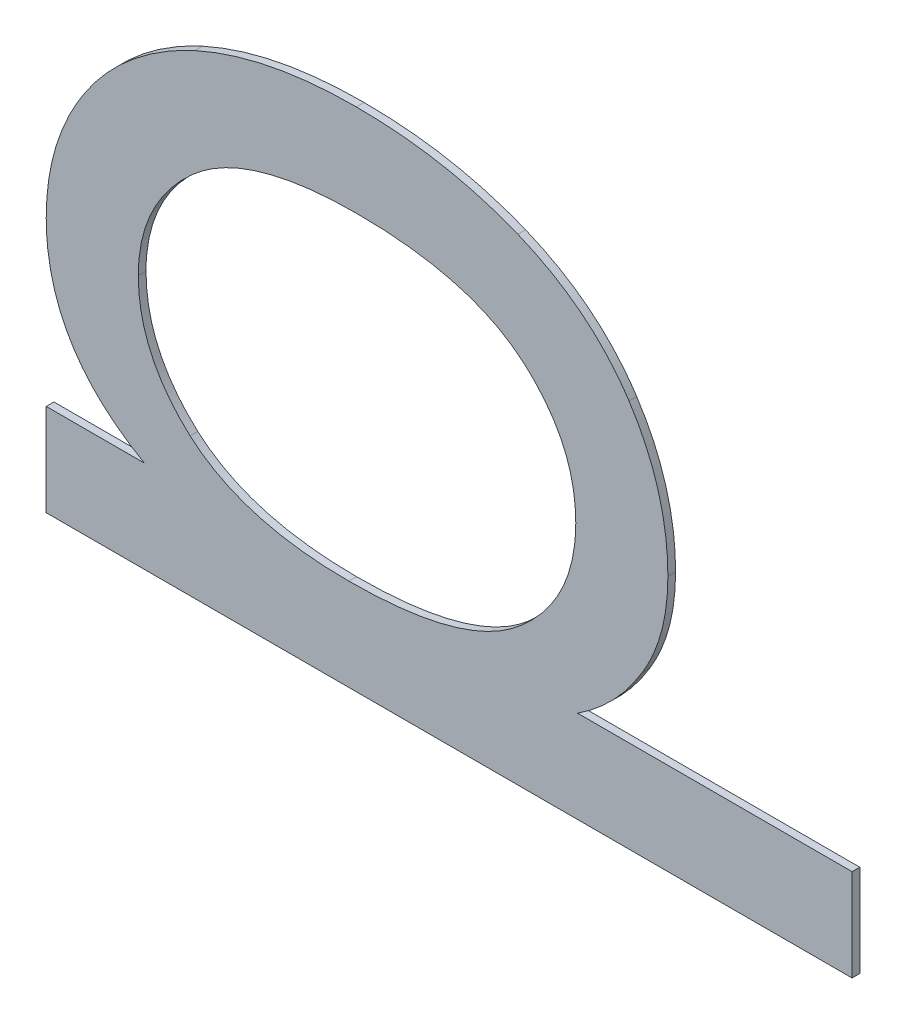
ISO-10303-21;
HEADER;
FILE_DESCRIPTION(('STEP AP214'),'2;1');
FILE_NAME('part.step','',(''),(''),'','','');
FILE_SCHEMA(('AUTOMOTIVE_DESIGN { 1 0 10303 214 1 1 1 1 }'));
ENDSEC;
DATA;
#1=APPLICATION_CONTEXT('core data for automotive mechanical design processes');
#2=APPLICATION_PROTOCOL_DEFINITION('international standard','automotive_design',2000,#1);
#3=PRODUCT_CONTEXT('',#1,'mechanical');
#4=PRODUCT('Part','Part','',(#3));
#5=PRODUCT_RELATED_PRODUCT_CATEGORY('part','',(#4));
#6=PRODUCT_DEFINITION_FORMATION('','',#4);
#7=PRODUCT_DEFINITION_CONTEXT('part definition',#1,'design');
#8=PRODUCT_DEFINITION('design','',#6,#7);
#9=PRODUCT_DEFINITION_SHAPE('','',#8);
#10=(LENGTH_UNIT() NAMED_UNIT(*) SI_UNIT(.MILLI.,.METRE.));
#11=(NAMED_UNIT(*) PLANE_ANGLE_UNIT() SI_UNIT($,.RADIAN.));
#12=(NAMED_UNIT(*) SI_UNIT($,.STERADIAN.) SOLID_ANGLE_UNIT());
#13=UNCERTAINTY_MEASURE_WITH_UNIT(LENGTH_MEASURE(1.E-05),#10,'distance_accuracy_value','');
#14=(GEOMETRIC_REPRESENTATION_CONTEXT(3) GLOBAL_UNCERTAINTY_ASSIGNED_CONTEXT((#13)) GLOBAL_UNIT_ASSIGNED_CONTEXT((#10,
#11,#12)) REPRESENTATION_CONTEXT('',''));
#15=CARTESIAN_POINT('',(0.,0.,0.));
#16=DIRECTION('',(0.,0.,1.));
#17=DIRECTION('',(1.,0.,0.));
#18=AXIS2_PLACEMENT_3D('',#15,#16,#17);
#19=CARTESIAN_POINT('',(1.0876144979876,1.2627711157743,1.7496000059366));
#20=DIRECTION('',(0.,1.,0.));
#21=DIRECTION('',(0.,0.,1.));
#22=AXIS2_PLACEMENT_3D('',#19,#20,#21);
#23=PLANE('',#22);
#24=DIRECTION('',(0.,0.,1.));
#25=VECTOR('',#24,1.);
#26=CARTESIAN_POINT('',(1.0850641795163,1.2627711157743,1.7492000059366));
#27=LINE('',#26,#25);
#28=CARTESIAN_POINT('',(1.0850641795163,1.2627711157743,1.7492000059366));
#29=VERTEX_POINT('',#28);
#30=CARTESIAN_POINT('',(1.0850641795163,1.2627711157743,1.7496000059366));
#31=VERTEX_POINT('',#30);
#32=EDGE_CURVE('E11',#29,#31,#27,.T.);
#33=ORIENTED_EDGE('',*,*,#32,.T.);
#34=DIRECTION('',(1.,0.,0.));
#35=VECTOR('',#34,1.);
#36=CARTESIAN_POINT('',(1.0850641795163,1.2627711157743,1.7496000059366));
#37=LINE('',#36,#35);
#38=CARTESIAN_POINT('',(1.0901648164589,1.2627711157743,1.7496000059366));
#39=VERTEX_POINT('',#38);
#40=EDGE_CURVE('E24',#31,#39,#37,.T.);
#41=ORIENTED_EDGE('',*,*,#40,.T.);
#42=DIRECTION('',(0.,0.,1.));
#43=VECTOR('',#42,1.);
#44=CARTESIAN_POINT('',(1.0901648164589,1.2627711157743,1.7492000059366));
#45=LINE('',#44,#43);
#46=CARTESIAN_POINT('',(1.0901648164589,1.2627711157743,1.7492000059366));
#47=VERTEX_POINT('',#46);
#48=EDGE_CURVE('E510',#47,#39,#45,.T.);
#49=ORIENTED_EDGE('',*,*,#48,.F.);
#50=DIRECTION('',(1.,0.,0.));
#51=VECTOR('',#50,1.);
#52=CARTESIAN_POINT('',(1.0850641795163,1.2627711157743,1.7492000059366));
#53=LINE('',#52,#51);
#54=EDGE_CURVE('E504',#29,#47,#53,.T.);
#55=ORIENTED_EDGE('',*,*,#54,.F.);
#56=EDGE_LOOP('',(#33,#41,#49,#55));
#57=FACE_BOUND('',#56,.T.);
#58=ADVANCED_FACE('F17',(#57),#23,.T.);
#59=CARTESIAN_POINT('',(1.0901648164589,1.2627711157743,1.7496000059366));
#60=CARTESIAN_POINT('',(1.0901648164589,1.2627711157743,1.7491200059366));
#61=CARTESIAN_POINT('',(1.0850641795163,1.2656483981523,1.7496000059366));
#62=CARTESIAN_POINT('',(1.0850641795163,1.2656483981523,1.7491200059366));
#63=CARTESIAN_POINT('',(1.0850641795163,1.2712534936937,1.7496000059366));
#64=CARTESIAN_POINT('',(1.0850641795163,1.2712534936937,1.7491200059366));
#65=B_SPLINE_SURFACE_WITH_KNOTS('',2,1,((#59,#60),(#61,#62),(#63,#64)),.UNSPECIFIED.,.F.,.F.,
.F.,(3,3),(2,2),(0.,1.),(0.,0.000239999999999974),.UNSPECIFIED.);
#66=CARTESIAN_POINT('',(1.0901648164589,1.2627711157743,1.7496000059366));
#67=CARTESIAN_POINT('',(1.0850641795163,1.2656483981523,1.7496000059366));
#68=CARTESIAN_POINT('',(1.0850641795163,1.2712534936937,1.7496000059366));
#69=B_SPLINE_CURVE_WITH_KNOTS('',2,(#66,#67,#68),.UNSPECIFIED.,.F.,.F.,(3,3),(0.,1.),.UNSPECIFIED.);
#70=CARTESIAN_POINT('',(1.0850641795163,1.2712534936937,1.7496000059366));
#71=VERTEX_POINT('',#70);
#72=EDGE_CURVE('E500',#39,#71,#69,.T.);
#73=DIRECTION('',(0.,0.,1.));
#74=VECTOR('',#73,1.);
#75=CARTESIAN_POINT('',(1.0850641795163,1.2712534936937,1.7492000059366));
#76=LINE('',#75,#74);
#77=CARTESIAN_POINT('',(1.0850641795163,1.2712534936937,1.7492000059366));
#78=VERTEX_POINT('',#77);
#79=EDGE_CURVE('E494',#78,#71,#76,.T.);
#80=CARTESIAN_POINT('',(1.0901648164589,1.2627711157743,1.7492000059366));
#81=CARTESIAN_POINT('',(1.0850641795163,1.2656483981523,1.7492000059366));
#82=CARTESIAN_POINT('',(1.0850641795163,1.2712534936937,1.7492000059366));
#83=B_SPLINE_CURVE_WITH_KNOTS('',2,(#80,#81,#82),.UNSPECIFIED.,.F.,.F.,(3,3),(0.,1.),.UNSPECIFIED.);
#84=EDGE_CURVE('E486',#47,#78,#83,.T.);
#85=ORIENTED_EDGE('',*,*,#48,.T.);
#86=ORIENTED_EDGE('',*,*,#72,.T.);
#87=ORIENTED_EDGE('',*,*,#79,.F.);
#88=ORIENTED_EDGE('',*,*,#84,.F.);
#89=EDGE_LOOP('',(#85,#86,#87,#88));
#90=FACE_BOUND('',#89,.T.);
#91=ADVANCED_FACE('F517',(#90),#65,.T.);
#92=CARTESIAN_POINT('',(1.0850641795163,1.2712534936937,1.7496000059366));
#93=CARTESIAN_POINT('',(1.0850641795163,1.2712534936937,1.7491200059366));
#94=CARTESIAN_POINT('',(1.0850641795163,1.2748781221439,1.7496000059366));
#95=CARTESIAN_POINT('',(1.0850641795163,1.2748781221439,1.7491200059366));
#96=CARTESIAN_POINT('',(1.0871006975631,1.2779235573879,1.7496000059366));
#97=CARTESIAN_POINT('',(1.0871006975631,1.2779235573879,1.7491200059366));
#98=B_SPLINE_SURFACE_WITH_KNOTS('',2,1,((#92,#93),(#94,#95),(#96,#97)),.UNSPECIFIED.,.F.,.F.,
.F.,(3,3),(2,2),(0.,1.),(0.,0.000239999999999974),.UNSPECIFIED.);
#99=CARTESIAN_POINT('',(1.0850641795163,1.2712534936937,1.7496000059366));
#100=CARTESIAN_POINT('',(1.0850641795163,1.2748781221439,1.7496000059366));
#101=CARTESIAN_POINT('',(1.0871006975631,1.2779235573879,1.7496000059366));
#102=B_SPLINE_CURVE_WITH_KNOTS('',2,(#99,#100,#101),.UNSPECIFIED.,.F.,.F.,(3,3),(0.,1.),.UNSPECIFIED.);
#103=CARTESIAN_POINT('',(1.0871006975631,1.2779235573879,1.7496000059366));
#104=VERTEX_POINT('',#103);
#105=EDGE_CURVE('E482',#71,#104,#102,.T.);
#106=DIRECTION('',(0.,0.,1.));
#107=VECTOR('',#106,1.);
#108=CARTESIAN_POINT('',(1.0871006975631,1.2779235573879,1.7492000059366));
#109=LINE('',#108,#107);
#110=CARTESIAN_POINT('',(1.0871006975631,1.2779235573879,1.7492000059366));
#111=VERTEX_POINT('',#110);
#112=EDGE_CURVE('E476',#111,#104,#109,.T.);
#113=CARTESIAN_POINT('',(1.0850641795163,1.2712534936937,1.7492000059366));
#114=CARTESIAN_POINT('',(1.0850641795163,1.2748781221439,1.7492000059366));
#115=CARTESIAN_POINT('',(1.0871006975631,1.2779235573879,1.7492000059366));
#116=B_SPLINE_CURVE_WITH_KNOTS('',2,(#113,#114,#115),.UNSPECIFIED.,.F.,.F.,(3,3),(0.,1.),.UNSPECIFIED.);
#117=EDGE_CURVE('E468',#78,#111,#116,.T.);
#118=ORIENTED_EDGE('',*,*,#79,.T.);
#119=ORIENTED_EDGE('',*,*,#105,.T.);
#120=ORIENTED_EDGE('',*,*,#112,.F.);
#121=ORIENTED_EDGE('',*,*,#117,.F.);
#122=EDGE_LOOP('',(#118,#119,#120,#121));
#123=FACE_BOUND('',#122,.T.);
#124=ADVANCED_FACE('F524',(#123),#98,.T.);
#125=CARTESIAN_POINT('',(1.0871006975631,1.2779235573879,1.7496000059366));
#126=CARTESIAN_POINT('',(1.0871006975631,1.2779235573879,1.7491200059366));
#127=CARTESIAN_POINT('',(1.0891372156097,1.2809503089803,1.7496000059366));
#128=CARTESIAN_POINT('',(1.0891372156097,1.2809503089803,1.7491200059366));
#129=CARTESIAN_POINT('',(1.0927805277117,1.2826318376427,1.7496000059366));
#130=CARTESIAN_POINT('',(1.0927805277117,1.2826318376427,1.7491200059366));
#131=B_SPLINE_SURFACE_WITH_KNOTS('',2,1,((#125,#126),(#127,#128),(#129,#130)),.UNSPECIFIED.,.F.,
.F.,.F.,(3,3),(2,2),(0.,1.),(0.,0.000239999999999974),.UNSPECIFIED.);
#132=CARTESIAN_POINT('',(1.0871006975631,1.2779235573879,1.7496000059366));
#133=CARTESIAN_POINT('',(1.0891372156097,1.2809503089803,1.7496000059366));
#134=CARTESIAN_POINT('',(1.0927805277117,1.2826318376427,1.7496000059366));
#135=B_SPLINE_CURVE_WITH_KNOTS('',2,(#132,#133,#134),.UNSPECIFIED.,.F.,.F.,(3,3),(0.,1.),.UNSPECIFIED.);
#136=CARTESIAN_POINT('',(1.0927805277117,1.2826318376427,1.7496000059366));
#137=VERTEX_POINT('',#136);
#138=EDGE_CURVE('E464',#104,#137,#135,.T.);
#139=DIRECTION('',(0.,0.,1.));
#140=VECTOR('',#139,1.);
#141=CARTESIAN_POINT('',(1.0927805277117,1.2826318376427,1.7492000059366));
#142=LINE('',#141,#140);
#143=CARTESIAN_POINT('',(1.0927805277117,1.2826318376427,1.7492000059366));
#144=VERTEX_POINT('',#143);
#145=EDGE_CURVE('E458',#144,#137,#142,.T.);
#146=CARTESIAN_POINT('',(1.0871006975631,1.2779235573879,1.7492000059366));
#147=CARTESIAN_POINT('',(1.0891372156097,1.2809503089803,1.7492000059366));
#148=CARTESIAN_POINT('',(1.0927805277117,1.2826318376427,1.7492000059366));
#149=B_SPLINE_CURVE_WITH_KNOTS('',2,(#146,#147,#148),.UNSPECIFIED.,.F.,.F.,(3,3),(0.,1.),.UNSPECIFIED.);
#150=EDGE_CURVE('E450',#111,#144,#149,.T.);
#151=ORIENTED_EDGE('',*,*,#112,.T.);
#152=ORIENTED_EDGE('',*,*,#138,.T.);
#153=ORIENTED_EDGE('',*,*,#145,.F.);
#154=ORIENTED_EDGE('',*,*,#150,.F.);
#155=EDGE_LOOP('',(#151,#152,#153,#154));
#156=FACE_BOUND('',#155,.T.);
#157=ADVANCED_FACE('F528',(#156),#131,.T.);
#158=CARTESIAN_POINT('',(1.0927805277117,1.2826318376427,1.7496000059366));
#159=CARTESIAN_POINT('',(1.0927805277117,1.2826318376427,1.7491200059366));
#160=CARTESIAN_POINT('',(1.0964425234653,1.2842946826533,1.7496000059366));
#161=CARTESIAN_POINT('',(1.0964425234653,1.2842946826533,1.7491200059366));
#162=CARTESIAN_POINT('',(1.1011694873719,1.2842946826533,1.7496000059366));
#163=CARTESIAN_POINT('',(1.1011694873719,1.2842946826533,1.7491200059366));
#164=B_SPLINE_SURFACE_WITH_KNOTS('',2,1,((#158,#159),(#160,#161),(#162,#163)),.UNSPECIFIED.,.F.,
.F.,.F.,(3,3),(2,2),(0.,1.),(0.,0.000239999999999974),.UNSPECIFIED.);
#165=CARTESIAN_POINT('',(1.0927805277117,1.2826318376427,1.7496000059366));
#166=CARTESIAN_POINT('',(1.0964425234653,1.2842946826533,1.7496000059366));
#167=CARTESIAN_POINT('',(1.1011694873719,1.2842946826533,1.7496000059366));
#168=B_SPLINE_CURVE_WITH_KNOTS('',2,(#165,#166,#167),.UNSPECIFIED.,.F.,.F.,(3,3),(0.,1.),.UNSPECIFIED.);
#169=CARTESIAN_POINT('',(1.1011694873719,1.2842946826533,1.7496000059366));
#170=VERTEX_POINT('',#169);
#171=EDGE_CURVE('E446',#137,#170,#168,.T.);
#172=DIRECTION('',(0.,0.,1.));
#173=VECTOR('',#172,1.);
#174=CARTESIAN_POINT('',(1.1011694873719,1.2842946826533,1.7492000059366));
#175=LINE('',#174,#173);
#176=CARTESIAN_POINT('',(1.1011694873719,1.2842946826533,1.7492000059366));
#177=VERTEX_POINT('',#176);
#178=EDGE_CURVE('E440',#177,#170,#175,.T.);
#179=CARTESIAN_POINT('',(1.0927805277117,1.2826318376427,1.7492000059366));
#180=CARTESIAN_POINT('',(1.0964425234653,1.2842946826533,1.7492000059366));
#181=CARTESIAN_POINT('',(1.1011694873719,1.2842946826533,1.7492000059366));
#182=B_SPLINE_CURVE_WITH_KNOTS('',2,(#179,#180,#181),.UNSPECIFIED.,.F.,.F.,(3,3),(0.,1.),.UNSPECIFIED.);
#183=EDGE_CURVE('E432',#144,#177,#182,.T.);
#184=ORIENTED_EDGE('',*,*,#145,.T.);
#185=ORIENTED_EDGE('',*,*,#171,.T.);
#186=ORIENTED_EDGE('',*,*,#178,.F.);
#187=ORIENTED_EDGE('',*,*,#183,.F.);
#188=EDGE_LOOP('',(#184,#185,#186,#187));
#189=FACE_BOUND('',#188,.T.);
#190=ADVANCED_FACE('F533',(#189),#164,.T.);
#191=CARTESIAN_POINT('',(1.1011694873719,1.2842946826533,1.7496000059366));
#192=CARTESIAN_POINT('',(1.1011694873719,1.2842946826533,1.7491200059366));
#193=CARTESIAN_POINT('',(1.1058030330195,1.2842946826533,1.7496000059366));
#194=CARTESIAN_POINT('',(1.1058030330195,1.2842946826533,1.7491200059366));
#195=CARTESIAN_POINT('',(1.1095584470323,1.2827626232053,1.7496000059366));
#196=CARTESIAN_POINT('',(1.1095584470323,1.2827626232053,1.7491200059366));
#197=B_SPLINE_SURFACE_WITH_KNOTS('',2,1,((#191,#192),(#193,#194),(#195,#196)),.UNSPECIFIED.,.F.,
.F.,.F.,(3,3),(2,2),(0.,1.),(0.,0.000239999999999974),.UNSPECIFIED.);
#198=CARTESIAN_POINT('',(1.1011694873719,1.2842946826533,1.7496000059366));
#199=CARTESIAN_POINT('',(1.1058030330195,1.2842946826533,1.7496000059366));
#200=CARTESIAN_POINT('',(1.1095584470323,1.2827626232053,1.7496000059366));
#201=B_SPLINE_CURVE_WITH_KNOTS('',2,(#198,#199,#200),.UNSPECIFIED.,.F.,.F.,(3,3),(0.,1.),.UNSPECIFIED.);
#202=CARTESIAN_POINT('',(1.1095584470323,1.2827626232053,1.7496000059366));
#203=VERTEX_POINT('',#202);
#204=EDGE_CURVE('E428',#170,#203,#201,.T.);
#205=DIRECTION('',(0.,0.,1.));
#206=VECTOR('',#205,1.);
#207=CARTESIAN_POINT('',(1.1095584470323,1.2827626232053,1.7492000059366));
#208=LINE('',#207,#206);
#209=CARTESIAN_POINT('',(1.1095584470323,1.2827626232053,1.7492000059366));
#210=VERTEX_POINT('',#209);
#211=EDGE_CURVE('E422',#210,#203,#208,.T.);
#212=CARTESIAN_POINT('',(1.1011694873719,1.2842946826533,1.7492000059366));
#213=CARTESIAN_POINT('',(1.1058030330195,1.2842946826533,1.7492000059366));
#214=CARTESIAN_POINT('',(1.1095584470323,1.2827626232053,1.7492000059366));
#215=B_SPLINE_CURVE_WITH_KNOTS('',2,(#212,#213,#214),.UNSPECIFIED.,.F.,.F.,(3,3),(0.,1.),.UNSPECIFIED.);
#216=EDGE_CURVE('E414',#177,#210,#215,.T.);
#217=ORIENTED_EDGE('',*,*,#178,.T.);
#218=ORIENTED_EDGE('',*,*,#204,.T.);
#219=ORIENTED_EDGE('',*,*,#211,.F.);
#220=ORIENTED_EDGE('',*,*,#216,.F.);
#221=EDGE_LOOP('',(#217,#218,#219,#220));
#222=FACE_BOUND('',#221,.T.);
#223=ADVANCED_FACE('F536',(#222),#197,.T.);
#224=CARTESIAN_POINT('',(1.1095584470323,1.2827626232053,1.7496000059366));
#225=CARTESIAN_POINT('',(1.1095584470323,1.2827626232053,1.7491200059366));
#226=CARTESIAN_POINT('',(1.1133325446967,1.2812118801055,1.7496000059366));
#227=CARTESIAN_POINT('',(1.1133325446967,1.2812118801055,1.7491200059366));
#228=CARTESIAN_POINT('',(1.1153316954399,1.2781477612097,1.7496000059366));
#229=CARTESIAN_POINT('',(1.1153316954399,1.2781477612097,1.7491200059366));
#230=B_SPLINE_SURFACE_WITH_KNOTS('',2,1,((#224,#225),(#226,#227),(#228,#229)),.UNSPECIFIED.,.F.,
.F.,.F.,(3,3),(2,2),(0.,1.),(0.,0.000239999999999974),.UNSPECIFIED.);
#231=CARTESIAN_POINT('',(1.1095584470323,1.2827626232053,1.7496000059366));
#232=CARTESIAN_POINT('',(1.1133325446967,1.2812118801055,1.7496000059366));
#233=CARTESIAN_POINT('',(1.1153316954399,1.2781477612097,1.7496000059366));
#234=B_SPLINE_CURVE_WITH_KNOTS('',2,(#231,#232,#233),.UNSPECIFIED.,.F.,.F.,(3,3),(0.,1.),.UNSPECIFIED.);
#235=CARTESIAN_POINT('',(1.1153316954399,1.2781477612097,1.7496000059366));
#236=VERTEX_POINT('',#235);
#237=EDGE_CURVE('E410',#203,#236,#234,.T.);
#238=DIRECTION('',(0.,0.,1.));
#239=VECTOR('',#238,1.);
#240=CARTESIAN_POINT('',(1.1153316954399,1.2781477612097,1.7492000059366));
#241=LINE('',#240,#239);
#242=CARTESIAN_POINT('',(1.1153316954399,1.2781477612097,1.7492000059366));
#243=VERTEX_POINT('',#242);
#244=EDGE_CURVE('E404',#243,#236,#241,.T.);
#245=CARTESIAN_POINT('',(1.1095584470323,1.2827626232053,1.7492000059366));
#246=CARTESIAN_POINT('',(1.1133325446967,1.2812118801055,1.7492000059366));
#247=CARTESIAN_POINT('',(1.1153316954399,1.2781477612097,1.7492000059366));
#248=B_SPLINE_CURVE_WITH_KNOTS('',2,(#245,#246,#247),.UNSPECIFIED.,.F.,.F.,(3,3),(0.,1.),.UNSPECIFIED.);
#249=EDGE_CURVE('E396',#210,#243,#248,.T.);
#250=ORIENTED_EDGE('',*,*,#211,.T.);
#251=ORIENTED_EDGE('',*,*,#237,.T.);
#252=ORIENTED_EDGE('',*,*,#244,.F.);
#253=ORIENTED_EDGE('',*,*,#249,.F.);
#254=EDGE_LOOP('',(#250,#251,#252,#253));
#255=FACE_BOUND('',#254,.T.);
#256=ADVANCED_FACE('F541',(#255),#230,.T.);
#257=CARTESIAN_POINT('',(1.1153316954399,1.2781477612097,1.7496000059366));
#258=CARTESIAN_POINT('',(1.1153316954399,1.2781477612097,1.7491200059366));
#259=CARTESIAN_POINT('',(1.1173495298347,1.2750649586619,1.7496000059366));
#260=CARTESIAN_POINT('',(1.1173495298347,1.2750649586619,1.7491200059366));
#261=CARTESIAN_POINT('',(1.1173495298347,1.2712721773455,1.7496000059366));
#262=CARTESIAN_POINT('',(1.1173495298347,1.2712721773455,1.7491200059366));
#263=B_SPLINE_SURFACE_WITH_KNOTS('',2,1,((#257,#258),(#259,#260),(#261,#262)),.UNSPECIFIED.,.F.,
.F.,.F.,(3,3),(2,2),(0.,1.),(0.,0.000239999999999974),.UNSPECIFIED.);
#264=CARTESIAN_POINT('',(1.1153316954399,1.2781477612097,1.7496000059366));
#265=CARTESIAN_POINT('',(1.1173495298347,1.2750649586619,1.7496000059366));
#266=CARTESIAN_POINT('',(1.1173495298347,1.2712721773455,1.7496000059366));
#267=B_SPLINE_CURVE_WITH_KNOTS('',2,(#264,#265,#266),.UNSPECIFIED.,.F.,.F.,(3,3),(0.,1.),.UNSPECIFIED.);
#268=CARTESIAN_POINT('',(1.1173495298347,1.2712721773455,1.7496000059366));
#269=VERTEX_POINT('',#268);
#270=EDGE_CURVE('E392',#236,#269,#267,.T.);
#271=DIRECTION('',(0.,0.,1.));
#272=VECTOR('',#271,1.);
#273=CARTESIAN_POINT('',(1.1173495298347,1.2712721773455,1.7492000059366));
#274=LINE('',#273,#272);
#275=CARTESIAN_POINT('',(1.1173495298347,1.2712721773455,1.7492000059366));
#276=VERTEX_POINT('',#275);
#277=EDGE_CURVE('E386',#276,#269,#274,.T.);
#278=CARTESIAN_POINT('',(1.1153316954399,1.2781477612097,1.7492000059366));
#279=CARTESIAN_POINT('',(1.1173495298347,1.2750649586619,1.7492000059366));
#280=CARTESIAN_POINT('',(1.1173495298347,1.2712721773455,1.7492000059366));
#281=B_SPLINE_CURVE_WITH_KNOTS('',2,(#278,#279,#280),.UNSPECIFIED.,.F.,.F.,(3,3),(0.,1.),.UNSPECIFIED.);
#282=EDGE_CURVE('E378',#243,#276,#281,.T.);
#283=ORIENTED_EDGE('',*,*,#244,.T.);
#284=ORIENTED_EDGE('',*,*,#270,.T.);
#285=ORIENTED_EDGE('',*,*,#277,.F.);
#286=ORIENTED_EDGE('',*,*,#282,.F.);
#287=EDGE_LOOP('',(#283,#284,#285,#286));
#288=FACE_BOUND('',#287,.T.);
#289=ADVANCED_FACE('F545',(#288),#263,.T.);
#290=CARTESIAN_POINT('',(1.1173495298347,1.2712721773455,1.7496000059366));
#291=CARTESIAN_POINT('',(1.1173495298347,1.2712721773455,1.7491200059366));
#292=CARTESIAN_POINT('',(1.1173495298347,1.2684883132267,1.7496000059366));
#293=CARTESIAN_POINT('',(1.1173495298347,1.2684883132267,1.7491200059366));
#294=CARTESIAN_POINT('',(1.1160416742085,1.2663210096173,1.7496000059366));
#295=CARTESIAN_POINT('',(1.1160416742085,1.2663210096173,1.7491200059366));
#296=B_SPLINE_SURFACE_WITH_KNOTS('',2,1,((#290,#291),(#292,#293),(#294,#295)),.UNSPECIFIED.,.F.,
.F.,.F.,(3,3),(2,2),(0.,1.),(0.,0.000239999999999974),.UNSPECIFIED.);
#297=CARTESIAN_POINT('',(1.1173495298347,1.2712721773455,1.7496000059366));
#298=CARTESIAN_POINT('',(1.1173495298347,1.2684883132267,1.7496000059366));
#299=CARTESIAN_POINT('',(1.1160416742085,1.2663210096173,1.7496000059366));
#300=B_SPLINE_CURVE_WITH_KNOTS('',2,(#297,#298,#299),.UNSPECIFIED.,.F.,.F.,(3,3),(0.,1.),.UNSPECIFIED.);
#301=CARTESIAN_POINT('',(1.1160416742085,1.2663210096173,1.7496000059366));
#302=VERTEX_POINT('',#301);
#303=EDGE_CURVE('E374',#269,#302,#300,.T.);
#304=DIRECTION('',(0.,0.,1.));
#305=VECTOR('',#304,1.);
#306=CARTESIAN_POINT('',(1.1160416742085,1.2663210096173,1.7492000059366));
#307=LINE('',#306,#305);
#308=CARTESIAN_POINT('',(1.1160416742085,1.2663210096173,1.7492000059366));
#309=VERTEX_POINT('',#308);
#310=EDGE_CURVE('E368',#309,#302,#307,.T.);
#311=CARTESIAN_POINT('',(1.1173495298347,1.2712721773455,1.7492000059366));
#312=CARTESIAN_POINT('',(1.1173495298347,1.2684883132267,1.7492000059366));
#313=CARTESIAN_POINT('',(1.1160416742085,1.2663210096173,1.7492000059366));
#314=B_SPLINE_CURVE_WITH_KNOTS('',2,(#311,#312,#313),.UNSPECIFIED.,.F.,.F.,(3,3),(0.,1.),.UNSPECIFIED.);
#315=EDGE_CURVE('E360',#276,#309,#314,.T.);
#316=ORIENTED_EDGE('',*,*,#277,.T.);
#317=ORIENTED_EDGE('',*,*,#303,.T.);
#318=ORIENTED_EDGE('',*,*,#310,.F.);
#319=ORIENTED_EDGE('',*,*,#315,.F.);
#320=EDGE_LOOP('',(#316,#317,#318,#319));
#321=FACE_BOUND('',#320,.T.);
#322=ADVANCED_FACE('F549',(#321),#296,.T.);
#323=CARTESIAN_POINT('',(1.1160416742085,1.2663210096173,1.7496000059366));
#324=CARTESIAN_POINT('',(1.1160416742085,1.2663210096173,1.7491200059366));
#325=CARTESIAN_POINT('',(1.1147525022339,1.2641350223561,1.7496000059366));
#326=CARTESIAN_POINT('',(1.1147525022339,1.2641350223561,1.7491200059366));
#327=CARTESIAN_POINT('',(1.1126599332317,1.2627711157743,1.7496000059366));
#328=CARTESIAN_POINT('',(1.1126599332317,1.2627711157743,1.7491200059366));
#329=B_SPLINE_SURFACE_WITH_KNOTS('',2,1,((#323,#324),(#325,#326),(#327,#328)),.UNSPECIFIED.,.F.,
.F.,.F.,(3,3),(2,2),(0.,1.),(0.,0.000239999999999974),.UNSPECIFIED.);
#330=CARTESIAN_POINT('',(1.1160416742085,1.2663210096173,1.7496000059366));
#331=CARTESIAN_POINT('',(1.1147525022339,1.2641350223561,1.7496000059366));
#332=CARTESIAN_POINT('',(1.1126599332317,1.2627711157743,1.7496000059366));
#333=B_SPLINE_CURVE_WITH_KNOTS('',2,(#330,#331,#332),.UNSPECIFIED.,.F.,.F.,(3,3),(0.,1.),.UNSPECIFIED.);
#334=CARTESIAN_POINT('',(1.1126599332317,1.2627711157743,1.7496000059366));
#335=VERTEX_POINT('',#334);
#336=EDGE_CURVE('E356',#302,#335,#333,.T.);
#337=DIRECTION('',(0.,0.,1.));
#338=VECTOR('',#337,1.);
#339=CARTESIAN_POINT('',(1.1126599332317,1.2627711157743,1.7492000059366));
#340=LINE('',#339,#338);
#341=CARTESIAN_POINT('',(1.1126599332317,1.2627711157743,1.7492000059366));
#342=VERTEX_POINT('',#341);
#343=EDGE_CURVE('E350',#342,#335,#340,.T.);
#344=CARTESIAN_POINT('',(1.1160416742085,1.2663210096173,1.7492000059366));
#345=CARTESIAN_POINT('',(1.1147525022339,1.2641350223561,1.7492000059366));
#346=CARTESIAN_POINT('',(1.1126599332317,1.2627711157743,1.7492000059366));
#347=B_SPLINE_CURVE_WITH_KNOTS('',2,(#344,#345,#346),.UNSPECIFIED.,.F.,.F.,(3,3),(0.,1.),.UNSPECIFIED.);
#348=EDGE_CURVE('E345',#309,#342,#347,.T.);
#349=ORIENTED_EDGE('',*,*,#310,.T.);
#350=ORIENTED_EDGE('',*,*,#336,.T.);
#351=ORIENTED_EDGE('',*,*,#343,.F.);
#352=ORIENTED_EDGE('',*,*,#348,.F.);
#353=EDGE_LOOP('',(#349,#350,#351,#352));
#354=FACE_BOUND('',#353,.T.);
#355=ADVANCED_FACE('F552',(#354),#329,.T.);
#356=CARTESIAN_POINT('',(1.1197877463952,1.2627711157743,1.7496000059366));
#357=DIRECTION('',(0.,1.,0.));
#358=DIRECTION('',(0.,0.,1.));
#359=AXIS2_PLACEMENT_3D('',#356,#357,#358);
#360=PLANE('',#359);
#361=ORIENTED_EDGE('',*,*,#343,.T.);
#362=DIRECTION('',(1.,0.,0.));
#363=VECTOR('',#362,1.);
#364=CARTESIAN_POINT('',(1.1126599332317,1.2627711157743,1.7496000059366));
#365=LINE('',#364,#363);
#366=CARTESIAN_POINT('',(1.1269155595587,1.2627711157743,1.7496000059366));
#367=VERTEX_POINT('',#366);
#368=EDGE_CURVE('E343',#335,#367,#365,.T.);
#369=ORIENTED_EDGE('',*,*,#368,.T.);
#370=DIRECTION('',(0.,0.,1.));
#371=VECTOR('',#370,1.);
#372=CARTESIAN_POINT('',(1.1269155595587,1.2627711157743,1.7492000059366));
#373=LINE('',#372,#371);
#374=CARTESIAN_POINT('',(1.1269155595587,1.2627711157743,1.7492000059366));
#375=VERTEX_POINT('',#374);
#376=EDGE_CURVE('E340',#375,#367,#373,.T.);
#377=ORIENTED_EDGE('',*,*,#376,.F.);
#378=DIRECTION('',(1.,0.,0.));
#379=VECTOR('',#378,1.);
#380=CARTESIAN_POINT('',(1.1126599332317,1.2627711157743,1.7492000059366));
#381=LINE('',#380,#379);
#382=EDGE_CURVE('E337',#342,#375,#381,.T.);
#383=ORIENTED_EDGE('',*,*,#382,.F.);
#384=EDGE_LOOP('',(#361,#369,#377,#383));
#385=FACE_BOUND('',#384,.T.);
#386=ADVANCED_FACE('F557',(#385),#360,.T.);
#387=CARTESIAN_POINT('',(1.1269155595587,1.2603796083433,1.7496000059366));
#388=DIRECTION('',(1.,0.,0.));
#389=DIRECTION('',(0.,0.,-1.));
#390=AXIS2_PLACEMENT_3D('',#387,#388,#389);
#391=PLANE('',#390);
#392=ORIENTED_EDGE('',*,*,#376,.T.);
#393=DIRECTION('',(0.,-1.,0.));
#394=VECTOR('',#393,1.);
#395=CARTESIAN_POINT('',(1.1269155595587,1.2627711157743,1.7496000059366));
#396=LINE('',#395,#394);
#397=CARTESIAN_POINT('',(1.1269155595587,1.2579881009123,1.7496000059366));
#398=VERTEX_POINT('',#397);
#399=EDGE_CURVE('E335',#367,#398,#396,.T.);
#400=ORIENTED_EDGE('',*,*,#399,.T.);
#401=DIRECTION('',(0.,0.,1.));
#402=VECTOR('',#401,1.);
#403=CARTESIAN_POINT('',(1.1269155595587,1.2579881009123,1.7492000059366));
#404=LINE('',#403,#402);
#405=CARTESIAN_POINT('',(1.1269155595587,1.2579881009123,1.7492000059366));
#406=VERTEX_POINT('',#405);
#407=EDGE_CURVE('E332',#406,#398,#404,.T.);
#408=ORIENTED_EDGE('',*,*,#407,.F.);
#409=DIRECTION('',(0.,-1.,0.));
#410=VECTOR('',#409,1.);
#411=CARTESIAN_POINT('',(1.1269155595587,1.2627711157743,1.7492000059366));
#412=LINE('',#411,#410);
#413=EDGE_CURVE('E329',#375,#406,#412,.T.);
#414=ORIENTED_EDGE('',*,*,#413,.F.);
#415=EDGE_LOOP('',(#392,#400,#408,#414));
#416=FACE_BOUND('',#415,.T.);
#417=ADVANCED_FACE('F561',(#416),#391,.T.);
#418=CARTESIAN_POINT('',(1.1059898695375,1.2579881009123,1.7496000059366));
#419=DIRECTION('',(0.,-1.,0.));
#420=DIRECTION('',(0.,0.,-1.));
#421=AXIS2_PLACEMENT_3D('',#418,#419,#420);
#422=PLANE('',#421);
#423=ORIENTED_EDGE('',*,*,#407,.T.);
#424=DIRECTION('',(-1.,0.,0.));
#425=VECTOR('',#424,1.);
#426=CARTESIAN_POINT('',(1.1269155595587,1.2579881009123,1.7496000059366));
#427=LINE('',#426,#425);
#428=CARTESIAN_POINT('',(1.0850641795163,1.2579881009123,1.7496000059366));
#429=VERTEX_POINT('',#428);
#430=EDGE_CURVE('E327',#398,#429,#427,.T.);
#431=ORIENTED_EDGE('',*,*,#430,.T.);
#432=DIRECTION('',(0.,0.,1.));
#433=VECTOR('',#432,1.);
#434=CARTESIAN_POINT('',(1.0850641795163,1.2579881009123,1.7492000059366));
#435=LINE('',#434,#433);
#436=CARTESIAN_POINT('',(1.0850641795163,1.2579881009123,1.7492000059366));
#437=VERTEX_POINT('',#436);
#438=EDGE_CURVE('E324',#437,#429,#435,.T.);
#439=ORIENTED_EDGE('',*,*,#438,.F.);
#440=DIRECTION('',(-1.,0.,0.));
#441=VECTOR('',#440,1.);
#442=CARTESIAN_POINT('',(1.1269155595587,1.2579881009123,1.7492000059366));
#443=LINE('',#442,#441);
#444=EDGE_CURVE('E321',#406,#437,#443,.T.);
#445=ORIENTED_EDGE('',*,*,#444,.F.);
#446=EDGE_LOOP('',(#423,#431,#439,#445));
#447=FACE_BOUND('',#446,.T.);
#448=ADVANCED_FACE('F564',(#447),#422,.T.);
#449=CARTESIAN_POINT('',(1.0850641795163,1.2603796083433,1.7496000059366));
#450=DIRECTION('',(-1.,0.,0.));
#451=DIRECTION('',(0.,0.,1.));
#452=AXIS2_PLACEMENT_3D('',#449,#450,#451);
#453=PLANE('',#452);
#454=ORIENTED_EDGE('',*,*,#438,.T.);
#455=DIRECTION('',(0.,1.,0.));
#456=VECTOR('',#455,1.);
#457=CARTESIAN_POINT('',(1.0850641795163,1.2579881009123,1.7496000059366));
#458=LINE('',#457,#456);
#459=EDGE_CURVE('E319',#429,#31,#458,.T.);
#460=ORIENTED_EDGE('',*,*,#459,.T.);
#461=ORIENTED_EDGE('',*,*,#32,.F.);
#462=DIRECTION('',(0.,1.,0.));
#463=VECTOR('',#462,1.);
#464=CARTESIAN_POINT('',(1.0850641795163,1.2579881009123,1.7492000059366));
#465=LINE('',#464,#463);
#466=EDGE_CURVE('E316',#437,#29,#465,.T.);
#467=ORIENTED_EDGE('',*,*,#466,.F.);
#468=EDGE_LOOP('',(#454,#460,#461,#467));
#469=FACE_BOUND('',#468,.T.);
#470=ADVANCED_FACE('F565',(#469),#453,.T.);
#471=CARTESIAN_POINT('',(1.1011881710237,1.2795116677913,1.7496000059366));
#472=CARTESIAN_POINT('',(1.1011881710237,1.2795116677913,1.7491200059366));
#473=CARTESIAN_POINT('',(1.0954896572233,1.2795116677913,1.7496000059366));
#474=CARTESIAN_POINT('',(1.0954896572233,1.2795116677913,1.7491200059366));
#475=CARTESIAN_POINT('',(1.0926684258009,1.2770080584495,1.7496000059366));
#476=CARTESIAN_POINT('',(1.0926684258009,1.2770080584495,1.7491200059366));
#477=B_SPLINE_SURFACE_WITH_KNOTS('',2,1,((#471,#472),(#473,#474),(#475,#476)),.UNSPECIFIED.,.F.,
.F.,.F.,(3,3),(2,2),(0.,1.),(0.,0.000239999999999974),.UNSPECIFIED.);
#478=DIRECTION('',(0.,0.,1.));
#479=VECTOR('',#478,1.);
#480=CARTESIAN_POINT('',(1.1011881710237,1.2795116677913,1.7492000059366));
#481=LINE('',#480,#479);
#482=CARTESIAN_POINT('',(1.1011881710237,1.2795116677913,1.7492000059366));
#483=VERTEX_POINT('',#482);
#484=CARTESIAN_POINT('',(1.1011881710237,1.2795116677913,1.7496000059366));
#485=VERTEX_POINT('',#484);
#486=EDGE_CURVE('E186',#483,#485,#481,.T.);
#487=CARTESIAN_POINT('',(1.1011881710237,1.2795116677913,1.7496000059366));
#488=CARTESIAN_POINT('',(1.0954896572233,1.2795116677913,1.7496000059366));
#489=CARTESIAN_POINT('',(1.0926684258009,1.2770080584495,1.7496000059366));
#490=B_SPLINE_CURVE_WITH_KNOTS('',2,(#487,#488,#489),.UNSPECIFIED.,.F.,.F.,(3,3),(0.,1.),.UNSPECIFIED.);
#491=CARTESIAN_POINT('',(1.0926684258009,1.2770080584495,1.7496000059366));
#492=VERTEX_POINT('',#491);
#493=EDGE_CURVE('E308',#485,#492,#490,.T.);
#494=DIRECTION('',(0.,0.,1.));
#495=VECTOR('',#494,1.);
#496=CARTESIAN_POINT('',(1.0926684258009,1.2770080584495,1.7492000059366));
#497=LINE('',#496,#495);
#498=CARTESIAN_POINT('',(1.0926684258009,1.2770080584495,1.7492000059366));
#499=VERTEX_POINT('',#498);
#500=EDGE_CURVE('E302',#499,#492,#497,.T.);
#501=CARTESIAN_POINT('',(1.1011881710237,1.2795116677913,1.7492000059366));
#502=CARTESIAN_POINT('',(1.0954896572233,1.2795116677913,1.7492000059366));
#503=CARTESIAN_POINT('',(1.0926684258009,1.2770080584495,1.7492000059366));
#504=B_SPLINE_CURVE_WITH_KNOTS('',2,(#501,#502,#503),.UNSPECIFIED.,.F.,.F.,(3,3),(0.,1.),.UNSPECIFIED.);
#505=EDGE_CURVE('E295',#483,#499,#504,.T.);
#506=ORIENTED_EDGE('',*,*,#486,.T.);
#507=ORIENTED_EDGE('',*,*,#493,.T.);
#508=ORIENTED_EDGE('',*,*,#500,.F.);
#509=ORIENTED_EDGE('',*,*,#505,.F.);
#510=EDGE_LOOP('',(#506,#507,#508,#509));
#511=FACE_BOUND('',#510,.T.);
#512=ADVANCED_FACE('F567',(#511),#477,.T.);
#513=CARTESIAN_POINT('',(1.0926684258009,1.2770080584495,1.7496000059366));
#514=CARTESIAN_POINT('',(1.0926684258009,1.2770080584495,1.7491200059366));
#515=CARTESIAN_POINT('',(1.0898471943783,1.2744857654559,1.7496000059366));
#516=CARTESIAN_POINT('',(1.0898471943783,1.2744857654559,1.7491200059366));
#517=CARTESIAN_POINT('',(1.0898471943783,1.2710479735239,1.7496000059366));
#518=CARTESIAN_POINT('',(1.0898471943783,1.2710479735239,1.7491200059366));
#519=B_SPLINE_SURFACE_WITH_KNOTS('',2,1,((#513,#514),(#515,#516),(#517,#518)),.UNSPECIFIED.,.F.,
.F.,.F.,(3,3),(2,2),(0.,1.),(0.,0.000239999999999974),.UNSPECIFIED.);
#520=CARTESIAN_POINT('',(1.0926684258009,1.2770080584495,1.7496000059366));
#521=CARTESIAN_POINT('',(1.0898471943783,1.2744857654559,1.7496000059366));
#522=CARTESIAN_POINT('',(1.0898471943783,1.2710479735239,1.7496000059366));
#523=B_SPLINE_CURVE_WITH_KNOTS('',2,(#520,#521,#522),.UNSPECIFIED.,.F.,.F.,(3,3),(0.,1.),.UNSPECIFIED.);
#524=CARTESIAN_POINT('',(1.0898471943783,1.2710479735239,1.7496000059366));
#525=VERTEX_POINT('',#524);
#526=EDGE_CURVE('E291',#492,#525,#523,.T.);
#527=DIRECTION('',(0.,0.,1.));
#528=VECTOR('',#527,1.);
#529=CARTESIAN_POINT('',(1.0898471943783,1.2710479735239,1.7492000059366));
#530=LINE('',#529,#528);
#531=CARTESIAN_POINT('',(1.0898471943783,1.2710479735239,1.7492000059366));
#532=VERTEX_POINT('',#531);
#533=EDGE_CURVE('E285',#532,#525,#530,.T.);
#534=CARTESIAN_POINT('',(1.0926684258009,1.2770080584495,1.7492000059366));
#535=CARTESIAN_POINT('',(1.0898471943783,1.2744857654559,1.7492000059366));
#536=CARTESIAN_POINT('',(1.0898471943783,1.2710479735239,1.7492000059366));
#537=B_SPLINE_CURVE_WITH_KNOTS('',2,(#534,#535,#536),.UNSPECIFIED.,.F.,.F.,(3,3),(0.,1.),.UNSPECIFIED.);
#538=EDGE_CURVE('E277',#499,#532,#537,.T.);
#539=ORIENTED_EDGE('',*,*,#500,.T.);
#540=ORIENTED_EDGE('',*,*,#526,.T.);
#541=ORIENTED_EDGE('',*,*,#533,.F.);
#542=ORIENTED_EDGE('',*,*,#538,.F.);
#543=EDGE_LOOP('',(#539,#540,#541,#542));
#544=FACE_BOUND('',#543,.T.);
#545=ADVANCED_FACE('F574',(#544),#519,.T.);
#546=CARTESIAN_POINT('',(1.0898471943783,1.2710479735239,1.7496000059366));
#547=CARTESIAN_POINT('',(1.0898471943783,1.2710479735239,1.7491200059366));
#548=CARTESIAN_POINT('',(1.0898471943783,1.2675914979399,1.7496000059366));
#549=CARTESIAN_POINT('',(1.0898471943783,1.2675914979399,1.7491200059366));
#550=CARTESIAN_POINT('',(1.0925376402381,1.2651813068571,1.7496000059366));
#551=CARTESIAN_POINT('',(1.0925376402381,1.2651813068571,1.7491200059366));
#552=B_SPLINE_SURFACE_WITH_KNOTS('',2,1,((#546,#547),(#548,#549),(#550,#551)),.UNSPECIFIED.,.F.,
.F.,.F.,(3,3),(2,2),(0.,1.),(0.,0.000239999999999974),.UNSPECIFIED.);
#553=CARTESIAN_POINT('',(1.0898471943783,1.2710479735239,1.7496000059366));
#554=CARTESIAN_POINT('',(1.0898471943783,1.2675914979399,1.7496000059366));
#555=CARTESIAN_POINT('',(1.0925376402381,1.2651813068571,1.7496000059366));
#556=B_SPLINE_CURVE_WITH_KNOTS('',2,(#553,#554,#555),.UNSPECIFIED.,.F.,.F.,(3,3),(0.,1.),.UNSPECIFIED.);
#557=CARTESIAN_POINT('',(1.0925376402381,1.2651813068571,1.7496000059366));
#558=VERTEX_POINT('',#557);
#559=EDGE_CURVE('E273',#525,#558,#556,.T.);
#560=DIRECTION('',(0.,0.,1.));
#561=VECTOR('',#560,1.);
#562=CARTESIAN_POINT('',(1.0925376402381,1.2651813068571,1.7492000059366));
#563=LINE('',#562,#561);
#564=CARTESIAN_POINT('',(1.0925376402381,1.2651813068571,1.7492000059366));
#565=VERTEX_POINT('',#564);
#566=EDGE_CURVE('E267',#565,#558,#563,.T.);
#567=CARTESIAN_POINT('',(1.0898471943783,1.2710479735239,1.7492000059366));
#568=CARTESIAN_POINT('',(1.0898471943783,1.2675914979399,1.7492000059366));
#569=CARTESIAN_POINT('',(1.0925376402381,1.2651813068571,1.7492000059366));
#570=B_SPLINE_CURVE_WITH_KNOTS('',2,(#567,#568,#569),.UNSPECIFIED.,.F.,.F.,(3,3),(0.,1.),.UNSPECIFIED.);
#571=EDGE_CURVE('E259',#532,#565,#570,.T.);
#572=ORIENTED_EDGE('',*,*,#533,.T.);
#573=ORIENTED_EDGE('',*,*,#559,.T.);
#574=ORIENTED_EDGE('',*,*,#566,.F.);
#575=ORIENTED_EDGE('',*,*,#571,.F.);
#576=EDGE_LOOP('',(#572,#573,#574,#575));
#577=FACE_BOUND('',#576,.T.);
#578=ADVANCED_FACE('F699',(#577),#552,.T.);
#579=CARTESIAN_POINT('',(1.0925376402381,1.2651813068571,1.7496000059366));
#580=CARTESIAN_POINT('',(1.0925376402381,1.2651813068571,1.7491200059366));
#581=CARTESIAN_POINT('',(1.0952467697499,1.2627711157743,1.7496000059366));
#582=CARTESIAN_POINT('',(1.0952467697499,1.2627711157743,1.7491200059366));
#583=CARTESIAN_POINT('',(1.1007771306841,1.2627711157743,1.7496000059366));
#584=CARTESIAN_POINT('',(1.1007771306841,1.2627711157743,1.7491200059366));
#585=B_SPLINE_SURFACE_WITH_KNOTS('',2,1,((#579,#580),(#581,#582),(#583,#584)),.UNSPECIFIED.,.F.,
.F.,.F.,(3,3),(2,2),(0.,1.),(0.,0.000239999999999974),.UNSPECIFIED.);
#586=CARTESIAN_POINT('',(1.0925376402381,1.2651813068571,1.7496000059366));
#587=CARTESIAN_POINT('',(1.0952467697499,1.2627711157743,1.7496000059366));
#588=CARTESIAN_POINT('',(1.1007771306841,1.2627711157743,1.7496000059366));
#589=B_SPLINE_CURVE_WITH_KNOTS('',2,(#586,#587,#588),.UNSPECIFIED.,.F.,.F.,(3,3),(0.,1.),.UNSPECIFIED.);
#590=CARTESIAN_POINT('',(1.1007771306841,1.2627711157743,1.7496000059366));
#591=VERTEX_POINT('',#590);
#592=EDGE_CURVE('E255',#558,#591,#589,.T.);
#593=DIRECTION('',(0.,0.,1.));
#594=VECTOR('',#593,1.);
#595=CARTESIAN_POINT('',(1.1007771306841,1.2627711157743,1.7492000059366));
#596=LINE('',#595,#594);
#597=CARTESIAN_POINT('',(1.1007771306841,1.2627711157743,1.7492000059366));
#598=VERTEX_POINT('',#597);
#599=EDGE_CURVE('E249',#598,#591,#596,.T.);
#600=CARTESIAN_POINT('',(1.0925376402381,1.2651813068571,1.7492000059366));
#601=CARTESIAN_POINT('',(1.0952467697499,1.2627711157743,1.7492000059366));
#602=CARTESIAN_POINT('',(1.1007771306841,1.2627711157743,1.7492000059366));
#603=B_SPLINE_CURVE_WITH_KNOTS('',2,(#600,#601,#602),.UNSPECIFIED.,.F.,.F.,(3,3),(0.,1.),.UNSPECIFIED.);
#604=EDGE_CURVE('E241',#565,#598,#603,.T.);
#605=ORIENTED_EDGE('',*,*,#566,.T.);
#606=ORIENTED_EDGE('',*,*,#592,.T.);
#607=ORIENTED_EDGE('',*,*,#599,.F.);
#608=ORIENTED_EDGE('',*,*,#604,.F.);
#609=EDGE_LOOP('',(#605,#606,#607,#608));
#610=FACE_BOUND('',#609,.T.);
#611=ADVANCED_FACE('F709',(#610),#585,.T.);
#612=CARTESIAN_POINT('',(1.1007771306841,1.2627711157743,1.7496000059366));
#613=CARTESIAN_POINT('',(1.1007771306841,1.2627711157743,1.7491200059366));
#614=CARTESIAN_POINT('',(1.1068680011723,1.2627711157743,1.7496000059366));
#615=CARTESIAN_POINT('',(1.1068680011723,1.2627711157743,1.7491200059366));
#616=CARTESIAN_POINT('',(1.1097079162467,1.2652373578125,1.7496000059366));
#617=CARTESIAN_POINT('',(1.1097079162467,1.2652373578125,1.7491200059366));
#618=B_SPLINE_SURFACE_WITH_KNOTS('',2,1,((#612,#613),(#614,#615),(#616,#617)),.UNSPECIFIED.,.F.,
.F.,.F.,(3,3),(2,2),(0.,1.),(0.,0.000239999999999974),.UNSPECIFIED.);
#619=CARTESIAN_POINT('',(1.1007771306841,1.2627711157743,1.7496000059366));
#620=CARTESIAN_POINT('',(1.1068680011723,1.2627711157743,1.7496000059366));
#621=CARTESIAN_POINT('',(1.1097079162467,1.2652373578125,1.7496000059366));
#622=B_SPLINE_CURVE_WITH_KNOTS('',2,(#619,#620,#621),.UNSPECIFIED.,.F.,.F.,(3,3),(0.,1.),.UNSPECIFIED.);
#623=CARTESIAN_POINT('',(1.1097079162467,1.2652373578125,1.7496000059366));
#624=VERTEX_POINT('',#623);
#625=EDGE_CURVE('E237',#591,#624,#622,.T.);
#626=DIRECTION('',(0.,0.,1.));
#627=VECTOR('',#626,1.);
#628=CARTESIAN_POINT('',(1.1097079162467,1.2652373578125,1.7492000059366));
#629=LINE('',#628,#627);
#630=CARTESIAN_POINT('',(1.1097079162467,1.2652373578125,1.7492000059366));
#631=VERTEX_POINT('',#630);
#632=EDGE_CURVE('E231',#631,#624,#629,.T.);
#633=CARTESIAN_POINT('',(1.1007771306841,1.2627711157743,1.7492000059366));
#634=CARTESIAN_POINT('',(1.1068680011723,1.2627711157743,1.7492000059366));
#635=CARTESIAN_POINT('',(1.1097079162467,1.2652373578125,1.7492000059366));
#636=B_SPLINE_CURVE_WITH_KNOTS('',2,(#633,#634,#635),.UNSPECIFIED.,.F.,.F.,(3,3),(0.,1.),.UNSPECIFIED.);
#637=EDGE_CURVE('E224',#598,#631,#636,.T.);
#638=ORIENTED_EDGE('',*,*,#599,.T.);
#639=ORIENTED_EDGE('',*,*,#625,.T.);
#640=ORIENTED_EDGE('',*,*,#632,.F.);
#641=ORIENTED_EDGE('',*,*,#637,.F.);
#642=EDGE_LOOP('',(#638,#639,#640,#641));
#643=FACE_BOUND('',#642,.T.);
#644=ADVANCED_FACE('F719',(#643),#618,.T.);
#645=CARTESIAN_POINT('',(1.1097079162467,1.2652373578125,1.7496000059366));
#646=CARTESIAN_POINT('',(1.1097079162467,1.2652373578125,1.7491200059366));
#647=CARTESIAN_POINT('',(1.1125665149727,1.2676849161991,1.7496000059366));
#648=CARTESIAN_POINT('',(1.1125665149727,1.2676849161991,1.7491200059366));
#649=CARTESIAN_POINT('',(1.1125665149727,1.2712908609973,1.7496000059366));
#650=CARTESIAN_POINT('',(1.1125665149727,1.2712908609973,1.7491200059366));
#651=B_SPLINE_SURFACE_WITH_KNOTS('',2,1,((#645,#646),(#647,#648),(#649,#650)),.UNSPECIFIED.,.F.,
.F.,.F.,(3,3),(2,2),(0.,1.),(0.,0.000239999999999974),.UNSPECIFIED.);
#652=CARTESIAN_POINT('',(1.1097079162467,1.2652373578125,1.7496000059366));
#653=CARTESIAN_POINT('',(1.1125665149727,1.2676849161991,1.7496000059366));
#654=CARTESIAN_POINT('',(1.1125665149727,1.2712908609973,1.7496000059366));
#655=B_SPLINE_CURVE_WITH_KNOTS('',2,(#652,#653,#654),.UNSPECIFIED.,.F.,.F.,(3,3),(0.,1.),.UNSPECIFIED.);
#656=CARTESIAN_POINT('',(1.1125665149727,1.2712908609973,1.7496000059366));
#657=VERTEX_POINT('',#656);
#658=EDGE_CURVE('E220',#624,#657,#655,.T.);
#659=DIRECTION('',(0.,0.,1.));
#660=VECTOR('',#659,1.);
#661=CARTESIAN_POINT('',(1.1125665149727,1.2712908609973,1.7492000059366));
#662=LINE('',#661,#660);
#663=CARTESIAN_POINT('',(1.1125665149727,1.2712908609973,1.7492000059366));
#664=VERTEX_POINT('',#663);
#665=EDGE_CURVE('E215',#664,#657,#662,.T.);
#666=CARTESIAN_POINT('',(1.1097079162467,1.2652373578125,1.7492000059366));
#667=CARTESIAN_POINT('',(1.1125665149727,1.2676849161991,1.7492000059366));
#668=CARTESIAN_POINT('',(1.1125665149727,1.2712908609973,1.7492000059366));
#669=B_SPLINE_CURVE_WITH_KNOTS('',2,(#666,#667,#668),.UNSPECIFIED.,.F.,.F.,(3,3),(0.,1.),.UNSPECIFIED.);
#670=EDGE_CURVE('E182',#631,#664,#669,.T.);
#671=ORIENTED_EDGE('',*,*,#632,.T.);
#672=ORIENTED_EDGE('',*,*,#658,.T.);
#673=ORIENTED_EDGE('',*,*,#665,.F.);
#674=ORIENTED_EDGE('',*,*,#670,.F.);
#675=EDGE_LOOP('',(#671,#672,#673,#674));
#676=FACE_BOUND('',#675,.T.);
#677=ADVANCED_FACE('F729',(#676),#651,.T.);
#678=CARTESIAN_POINT('',(1.1125665149727,1.2712908609973,1.7496000059366));
#679=CARTESIAN_POINT('',(1.1125665149727,1.2712908609973,1.7491200059366));
#680=CARTESIAN_POINT('',(1.1125665149727,1.2748033875365,1.7496000059366));
#681=CARTESIAN_POINT('',(1.1125665149727,1.2748033875365,1.7491200059366));
#682=CARTESIAN_POINT('',(1.1098200181575,1.2771575276639,1.7496000059366));
#683=CARTESIAN_POINT('',(1.1098200181575,1.2771575276639,1.7491200059366));
#684=B_SPLINE_SURFACE_WITH_KNOTS('',2,1,((#678,#679),(#680,#681),(#682,#683)),.UNSPECIFIED.,.F.,
.F.,.F.,(3,3),(2,2),(0.,1.),(0.,0.000239999999999974),.UNSPECIFIED.);
#685=CARTESIAN_POINT('',(1.1125665149727,1.2712908609973,1.7496000059366));
#686=CARTESIAN_POINT('',(1.1125665149727,1.2748033875365,1.7496000059366));
#687=CARTESIAN_POINT('',(1.1098200181575,1.2771575276639,1.7496000059366));
#688=B_SPLINE_CURVE_WITH_KNOTS('',2,(#685,#686,#687),.UNSPECIFIED.,.F.,.F.,(3,3),(0.,1.),.UNSPECIFIED.);
#689=CARTESIAN_POINT('',(1.1098200181575,1.2771575276639,1.7496000059366));
#690=VERTEX_POINT('',#689);
#691=EDGE_CURVE('E168',#657,#690,#688,.T.);
#692=DIRECTION('',(0.,0.,1.));
#693=VECTOR('',#692,1.);
#694=CARTESIAN_POINT('',(1.1098200181575,1.2771575276639,1.7492000059366));
#695=LINE('',#694,#693);
#696=CARTESIAN_POINT('',(1.1098200181575,1.2771575276639,1.7492000059366));
#697=VERTEX_POINT('',#696);
#698=EDGE_CURVE('E162',#697,#690,#695,.T.);
#699=CARTESIAN_POINT('',(1.1125665149727,1.2712908609973,1.7492000059366));
#700=CARTESIAN_POINT('',(1.1125665149727,1.2748033875365,1.7492000059366));
#701=CARTESIAN_POINT('',(1.1098200181575,1.2771575276639,1.7492000059366));
#702=B_SPLINE_CURVE_WITH_KNOTS('',2,(#699,#700,#701),.UNSPECIFIED.,.F.,.F.,(3,3),(0.,1.),.UNSPECIFIED.);
#703=EDGE_CURVE('E166',#664,#697,#702,.T.);
#704=ORIENTED_EDGE('',*,*,#665,.T.);
#705=ORIENTED_EDGE('',*,*,#691,.T.);
#706=ORIENTED_EDGE('',*,*,#698,.F.);
#707=ORIENTED_EDGE('',*,*,#703,.F.);
#708=EDGE_LOOP('',(#704,#705,#706,#707));
#709=FACE_BOUND('',#708,.T.);
#710=ADVANCED_FACE('F165',(#709),#684,.T.);
#711=CARTESIAN_POINT('',(1.1098200181575,1.2771575276639,1.7496000059366));
#712=CARTESIAN_POINT('',(1.1098200181575,1.2771575276639,1.7491200059366));
#713=CARTESIAN_POINT('',(1.1070922049941,1.2795116677913,1.7496000059366));
#714=CARTESIAN_POINT('',(1.1070922049941,1.2795116677913,1.7491200059366));
#715=CARTESIAN_POINT('',(1.1011881710237,1.2795116677913,1.7496000059366));
#716=CARTESIAN_POINT('',(1.1011881710237,1.2795116677913,1.7491200059366));
#717=B_SPLINE_SURFACE_WITH_KNOTS('',2,1,((#711,#712),(#713,#714),(#715,#716)),.UNSPECIFIED.,.F.,
.F.,.F.,(3,3),(2,2),(0.,1.),(0.,0.000239999999999974),.UNSPECIFIED.);
#718=CARTESIAN_POINT('',(1.1098200181575,1.2771575276639,1.7496000059366));
#719=CARTESIAN_POINT('',(1.1070922049941,1.2795116677913,1.7496000059366));
#720=CARTESIAN_POINT('',(1.1011881710237,1.2795116677913,1.7496000059366));
#721=B_SPLINE_CURVE_WITH_KNOTS('',2,(#718,#719,#720),.UNSPECIFIED.,.F.,.F.,(3,3),(0.,1.),.UNSPECIFIED.);
#722=EDGE_CURVE('E183',#690,#485,#721,.T.);
#723=CARTESIAN_POINT('',(1.1098200181575,1.2771575276639,1.7492000059366));
#724=CARTESIAN_POINT('',(1.1070922049941,1.2795116677913,1.7492000059366));
#725=CARTESIAN_POINT('',(1.1011881710237,1.2795116677913,1.7492000059366));
#726=B_SPLINE_CURVE_WITH_KNOTS('',2,(#723,#724,#725),.UNSPECIFIED.,.F.,.F.,(3,3),(0.,1.),.UNSPECIFIED.);
#727=EDGE_CURVE('E179',#697,#483,#726,.T.);
#728=ORIENTED_EDGE('',*,*,#698,.T.);
#729=ORIENTED_EDGE('',*,*,#722,.T.);
#730=ORIENTED_EDGE('',*,*,#486,.F.);
#731=ORIENTED_EDGE('',*,*,#727,.F.);
#732=EDGE_LOOP('',(#728,#729,#730,#731));
#733=FACE_BOUND('',#732,.T.);
#734=ADVANCED_FACE('F185',(#733),#717,.T.);
#735=CARTESIAN_POINT('',(1.0850641795163,1.2711413917828,1.7492000059366));
#736=DIRECTION('',(0.,0.,-1.));
#737=DIRECTION('',(-1.,0.,0.));
#738=AXIS2_PLACEMENT_3D('',#735,#736,#737);
#739=PLANE('',#738);
#740=ORIENTED_EDGE('',*,*,#54,.T.);
#741=ORIENTED_EDGE('',*,*,#84,.T.);
#742=ORIENTED_EDGE('',*,*,#117,.T.);
#743=ORIENTED_EDGE('',*,*,#150,.T.);
#744=ORIENTED_EDGE('',*,*,#183,.T.);
#745=ORIENTED_EDGE('',*,*,#216,.T.);
#746=ORIENTED_EDGE('',*,*,#249,.T.);
#747=ORIENTED_EDGE('',*,*,#282,.T.);
#748=ORIENTED_EDGE('',*,*,#315,.T.);
#749=ORIENTED_EDGE('',*,*,#348,.T.);
#750=ORIENTED_EDGE('',*,*,#382,.T.);
#751=ORIENTED_EDGE('',*,*,#413,.T.);
#752=ORIENTED_EDGE('',*,*,#444,.T.);
#753=ORIENTED_EDGE('',*,*,#466,.T.);
#754=EDGE_LOOP('',(#740,#741,#742,#743,#744,#745,#746,#747,#748,#749,#750,#751,#752,#753));
#755=FACE_BOUND('',#754,.T.);
#756=ORIENTED_EDGE('',*,*,#505,.T.);
#757=ORIENTED_EDGE('',*,*,#538,.T.);
#758=ORIENTED_EDGE('',*,*,#571,.T.);
#759=ORIENTED_EDGE('',*,*,#604,.T.);
#760=ORIENTED_EDGE('',*,*,#637,.T.);
#761=ORIENTED_EDGE('',*,*,#670,.T.);
#762=ORIENTED_EDGE('',*,*,#703,.T.);
#763=ORIENTED_EDGE('',*,*,#727,.T.);
#764=EDGE_LOOP('',(#756,#757,#758,#759,#760,#761,#762,#763));
#765=FACE_BOUND('',#764,.T.);
#766=ADVANCED_FACE('F178',(#755,#765),#739,.T.);
#767=CARTESIAN_POINT('',(1.0850641795163,1.2711413917828,1.7496000059366));
#768=DIRECTION('',(0.,0.,-1.));
#769=DIRECTION('',(-1.,0.,0.));
#770=AXIS2_PLACEMENT_3D('',#767,#768,#769);
#771=PLANE('',#770);
#772=ORIENTED_EDGE('',*,*,#40,.F.);
#773=ORIENTED_EDGE('',*,*,#459,.F.);
#774=ORIENTED_EDGE('',*,*,#430,.F.);
#775=ORIENTED_EDGE('',*,*,#399,.F.);
#776=ORIENTED_EDGE('',*,*,#368,.F.);
#777=ORIENTED_EDGE('',*,*,#336,.F.);
#778=ORIENTED_EDGE('',*,*,#303,.F.);
#779=ORIENTED_EDGE('',*,*,#270,.F.);
#780=ORIENTED_EDGE('',*,*,#237,.F.);
#781=ORIENTED_EDGE('',*,*,#204,.F.);
#782=ORIENTED_EDGE('',*,*,#171,.F.);
#783=ORIENTED_EDGE('',*,*,#138,.F.);
#784=ORIENTED_EDGE('',*,*,#105,.F.);
#785=ORIENTED_EDGE('',*,*,#72,.F.);
#786=EDGE_LOOP('',(#772,#773,#774,#775,#776,#777,#778,#779,#780,#781,#782,#783,#784,#785));
#787=FACE_BOUND('',#786,.T.);
#788=ORIENTED_EDGE('',*,*,#493,.F.);
#789=ORIENTED_EDGE('',*,*,#722,.F.);
#790=ORIENTED_EDGE('',*,*,#691,.F.);
#791=ORIENTED_EDGE('',*,*,#658,.F.);
#792=ORIENTED_EDGE('',*,*,#625,.F.);
#793=ORIENTED_EDGE('',*,*,#592,.F.);
#794=ORIENTED_EDGE('',*,*,#559,.F.);
#795=ORIENTED_EDGE('',*,*,#526,.F.);
#796=EDGE_LOOP('',(#788,#789,#790,#791,#792,#793,#794,#795));
#797=FACE_BOUND('',#796,.T.);
#798=ADVANCED_FACE('F519',(#787,#797),#771,.F.);
#799=CLOSED_SHELL('',(#58,#91,#124,#157,#190,#223,#256,#289,#322,#355,#386,#417,#448,#470,#512,
#545,#578,#611,#644,#677,#710,#734,#766,#798));
#800=MANIFOLD_SOLID_BREP('B1',#799);
#801=ADVANCED_BREP_SHAPE_REPRESENTATION('',(#18,#800),#14);
#802=SHAPE_DEFINITION_REPRESENTATION(#9,#801);
ENDSEC;
END-ISO-10303-21;
